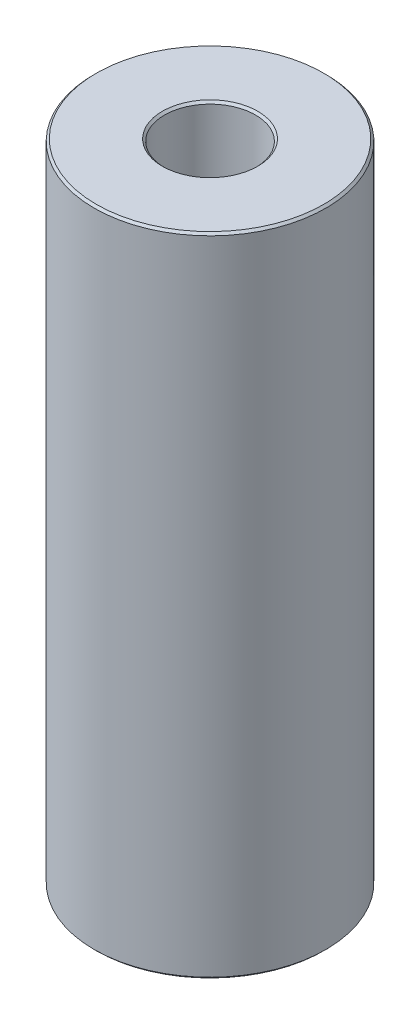
ISO-10303-21;
HEADER;
FILE_DESCRIPTION(('STEP AP214'),'2;1');
FILE_NAME('part.step','',(''),(''),'','','');
FILE_SCHEMA(('AUTOMOTIVE_DESIGN { 1 0 10303 214 1 1 1 1 }'));
ENDSEC;
DATA;
#1=APPLICATION_CONTEXT('core data for automotive mechanical design processes');
#2=APPLICATION_PROTOCOL_DEFINITION('international standard','automotive_design',2000,#1);
#3=PRODUCT_CONTEXT('',#1,'mechanical');
#4=PRODUCT('Part','Part','',(#3));
#5=PRODUCT_RELATED_PRODUCT_CATEGORY('part','',(#4));
#6=PRODUCT_DEFINITION_FORMATION('','',#4);
#7=PRODUCT_DEFINITION_CONTEXT('part definition',#1,'design');
#8=PRODUCT_DEFINITION('design','',#6,#7);
#9=PRODUCT_DEFINITION_SHAPE('','',#8);
#10=(LENGTH_UNIT() NAMED_UNIT(*) SI_UNIT(.MILLI.,.METRE.));
#11=(NAMED_UNIT(*) PLANE_ANGLE_UNIT() SI_UNIT($,.RADIAN.));
#12=(NAMED_UNIT(*) SI_UNIT($,.STERADIAN.) SOLID_ANGLE_UNIT());
#13=UNCERTAINTY_MEASURE_WITH_UNIT(LENGTH_MEASURE(1.E-05),#10,'distance_accuracy_value','');
#14=(GEOMETRIC_REPRESENTATION_CONTEXT(3) GLOBAL_UNCERTAINTY_ASSIGNED_CONTEXT((#13)) GLOBAL_UNIT_ASSIGNED_CONTEXT((#10,
#11,#12)) REPRESENTATION_CONTEXT('',''));
#15=CARTESIAN_POINT('',(0.,0.,0.));
#16=DIRECTION('',(0.,0.,1.));
#17=DIRECTION('',(1.,0.,0.));
#18=AXIS2_PLACEMENT_3D('',#15,#16,#17);
#19=CARTESIAN_POINT('',(0.,292.911476982028,0.));
#20=DIRECTION('',(0.,-1.,0.));
#21=DIRECTION('',(0.,0.,-1.));
#22=AXIS2_PLACEMENT_3D('',#19,#20,#21);
#23=CYLINDRICAL_SURFACE('',#22,52.5);
#24=CARTESIAN_POINT('',(0.,0.982913388469953,0.));
#25=DIRECTION('',(0.,1.,0.));
#26=DIRECTION('',(0.,0.,1.));
#27=AXIS2_PLACEMENT_3D('',#24,#25,#26);
#28=CIRCLE('',#27,52.5);
#29=CARTESIAN_POINT('',(0.,0.982913388469953,52.5));
#30=VERTEX_POINT('',#29);
#31=EDGE_CURVE('E10',#30,#30,#28,.T.);
#32=ORIENTED_EDGE('',*,*,#31,.T.);
#33=EDGE_LOOP('',(#32));
#34=FACE_BOUND('',#33,.T.);
#35=CARTESIAN_POINT('',(0.,291.928563593558,0.));
#36=DIRECTION('',(0.,1.,0.));
#37=DIRECTION('',(0.,0.,1.));
#38=AXIS2_PLACEMENT_3D('',#35,#36,#37);
#39=CIRCLE('',#38,52.5);
#40=CARTESIAN_POINT('',(0.,291.928563593558,52.5));
#41=VERTEX_POINT('',#40);
#42=EDGE_CURVE('E50',#41,#41,#39,.F.);
#43=ORIENTED_EDGE('',*,*,#42,.T.);
#44=EDGE_LOOP('',(#43));
#45=FACE_BOUND('',#44,.T.);
#46=ADVANCED_FACE('F39',(#34,#45),#23,.T.);
#47=CARTESIAN_POINT('',(0.,292.911476982028,0.));
#48=DIRECTION('',(0.,1.,0.));
#49=DIRECTION('',(0.,0.,1.));
#50=AXIS2_PLACEMENT_3D('',#47,#48,#49);
#51=PLANE('',#50);
#52=CARTESIAN_POINT('',(0.,292.911476982028,0.));
#53=DIRECTION('',(0.,1.,0.));
#54=DIRECTION('',(0.,0.,1.));
#55=AXIS2_PLACEMENT_3D('',#52,#53,#54);
#56=CIRCLE('',#55,21.6160008954077);
#57=CARTESIAN_POINT('',(0.,292.911476982028,21.6160008954077));
#58=VERTEX_POINT('',#57);
#59=EDGE_CURVE('E58',#58,#58,#56,.F.);
#60=ORIENTED_EDGE('',*,*,#59,.T.);
#61=EDGE_LOOP('',(#60));
#62=FACE_BOUND('',#61,.T.);
#63=CARTESIAN_POINT('',(0.,292.911476982028,0.));
#64=DIRECTION('',(0.,1.,0.));
#65=DIRECTION('',(0.,0.,1.));
#66=AXIS2_PLACEMENT_3D('',#63,#64,#65);
#67=CIRCLE('',#66,51.51708661153);
#68=CARTESIAN_POINT('',(0.,292.911476982028,51.51708661153));
#69=VERTEX_POINT('',#68);
#70=EDGE_CURVE('E61',#69,#69,#67,.T.);
#71=ORIENTED_EDGE('',*,*,#70,.T.);
#72=EDGE_LOOP('',(#71));
#73=FACE_BOUND('',#72,.T.);
#74=ADVANCED_FACE('F88',(#62,#73),#51,.T.);
#75=CARTESIAN_POINT('',(0.,0.,0.));
#76=DIRECTION('',(0.,1.,0.));
#77=DIRECTION('',(0.,0.,1.));
#78=AXIS2_PLACEMENT_3D('',#75,#76,#77);
#79=PLANE('',#78);
#80=CARTESIAN_POINT('',(0.,0.,0.));
#81=DIRECTION('',(0.,1.,0.));
#82=DIRECTION('',(0.,0.,1.));
#83=AXIS2_PLACEMENT_3D('',#80,#81,#82);
#84=CIRCLE('',#83,21.6160008954077);
#85=CARTESIAN_POINT('',(0.,0.,21.6160008954077));
#86=VERTEX_POINT('',#85);
#87=EDGE_CURVE('E51',#86,#86,#84,.T.);
#88=ORIENTED_EDGE('',*,*,#87,.T.);
#89=EDGE_LOOP('',(#88));
#90=FACE_BOUND('',#89,.T.);
#91=CARTESIAN_POINT('',(0.,0.,0.));
#92=DIRECTION('',(0.,1.,0.));
#93=DIRECTION('',(0.,0.,1.));
#94=AXIS2_PLACEMENT_3D('',#91,#92,#93);
#95=CIRCLE('',#94,51.5170866115301);
#96=CARTESIAN_POINT('',(0.,0.,51.5170866115301));
#97=VERTEX_POINT('',#96);
#98=EDGE_CURVE('E54',#97,#97,#95,.F.);
#99=ORIENTED_EDGE('',*,*,#98,.T.);
#100=EDGE_LOOP('',(#99));
#101=FACE_BOUND('',#100,.T.);
#102=ADVANCED_FACE('F83',(#90,#101),#79,.F.);
#103=CARTESIAN_POINT('',(0.,292.911476982028,0.));
#104=DIRECTION('',(0.,-1.,0.));
#105=DIRECTION('',(0.,0.,-1.));
#106=AXIS2_PLACEMENT_3D('',#103,#104,#105);
#107=CYLINDRICAL_SURFACE('',#106,20.6330875069378);
#108=CARTESIAN_POINT('',(0.,291.928563593558,0.));
#109=DIRECTION('',(0.,1.,0.));
#110=DIRECTION('',(0.,0.,1.));
#111=AXIS2_PLACEMENT_3D('',#108,#109,#110);
#112=CIRCLE('',#111,20.6330875069378);
#113=CARTESIAN_POINT('',(0.,291.928563593558,20.6330875069378));
#114=VERTEX_POINT('',#113);
#115=EDGE_CURVE('E67',#114,#114,#112,.T.);
#116=ORIENTED_EDGE('',*,*,#115,.T.);
#117=EDGE_LOOP('',(#116));
#118=FACE_BOUND('',#117,.T.);
#119=CARTESIAN_POINT('',(0.,0.982913388469953,0.));
#120=DIRECTION('',(0.,1.,0.));
#121=DIRECTION('',(0.,0.,1.));
#122=AXIS2_PLACEMENT_3D('',#119,#120,#121);
#123=CIRCLE('',#122,20.6330875069378);
#124=CARTESIAN_POINT('',(0.,0.982913388469953,20.6330875069378));
#125=VERTEX_POINT('',#124);
#126=EDGE_CURVE('E69',#125,#125,#123,.F.);
#127=ORIENTED_EDGE('',*,*,#126,.T.);
#128=EDGE_LOOP('',(#127));
#129=FACE_BOUND('',#128,.T.);
#130=ADVANCED_FACE('F71',(#118,#129),#107,.F.);
#131=CARTESIAN_POINT('',(0.,291.928563593558,0.));
#132=DIRECTION('',(0.,1.,0.));
#133=DIRECTION('',(0.,0.,1.));
#134=AXIS2_PLACEMENT_3D('',#131,#132,#133);
#135=CONICAL_SURFACE('',#134,20.6330875069378,0.785398163397445);
#136=ORIENTED_EDGE('',*,*,#59,.F.);
#137=EDGE_LOOP('',(#136));
#138=FACE_BOUND('',#137,.T.);
#139=ORIENTED_EDGE('',*,*,#115,.F.);
#140=EDGE_LOOP('',(#139));
#141=FACE_BOUND('',#140,.T.);
#142=ADVANCED_FACE('F77',(#138,#141),#135,.F.);
#143=CARTESIAN_POINT('',(0.,0.,0.));
#144=DIRECTION('',(0.,-1.,0.));
#145=DIRECTION('',(0.,0.,-1.));
#146=AXIS2_PLACEMENT_3D('',#143,#144,#145);
#147=CONICAL_SURFACE('',#146,21.6160008954077,0.785398163397445);
#148=ORIENTED_EDGE('',*,*,#126,.F.);
#149=EDGE_LOOP('',(#148));
#150=FACE_BOUND('',#149,.T.);
#151=ORIENTED_EDGE('',*,*,#87,.F.);
#152=EDGE_LOOP('',(#151));
#153=FACE_BOUND('',#152,.T.);
#154=ADVANCED_FACE('F73',(#150,#153),#147,.F.);
#155=CARTESIAN_POINT('',(0.,0.982913388469953,0.));
#156=DIRECTION('',(0.,1.,0.));
#157=DIRECTION('',(0.,0.,1.));
#158=AXIS2_PLACEMENT_3D('',#155,#156,#157);
#159=CONICAL_SURFACE('',#158,52.5,0.785398163397438);
#160=ORIENTED_EDGE('',*,*,#98,.F.);
#161=EDGE_LOOP('',(#160));
#162=FACE_BOUND('',#161,.T.);
#163=ORIENTED_EDGE('',*,*,#31,.F.);
#164=EDGE_LOOP('',(#163));
#165=FACE_BOUND('',#164,.T.);
#166=ADVANCED_FACE('F76',(#162,#165),#159,.T.);
#167=CARTESIAN_POINT('',(0.,292.911476982028,0.));
#168=DIRECTION('',(0.,-1.,0.));
#169=DIRECTION('',(0.,0.,-1.));
#170=AXIS2_PLACEMENT_3D('',#167,#168,#169);
#171=CONICAL_SURFACE('',#170,51.51708661153,0.785398163397448);
#172=ORIENTED_EDGE('',*,*,#42,.F.);
#173=EDGE_LOOP('',(#172));
#174=FACE_BOUND('',#173,.T.);
#175=ORIENTED_EDGE('',*,*,#70,.F.);
#176=EDGE_LOOP('',(#175));
#177=FACE_BOUND('',#176,.T.);
#178=ADVANCED_FACE('F45',(#174,#177),#171,.T.);
#179=CLOSED_SHELL('',(#46,#74,#102,#130,#142,#154,#166,#178));
#180=MANIFOLD_SOLID_BREP('B2',#179);
#181=ADVANCED_BREP_SHAPE_REPRESENTATION('',(#18,#180),#14);
#182=SHAPE_DEFINITION_REPRESENTATION(#9,#181);
ENDSEC;
END-ISO-10303-21;
